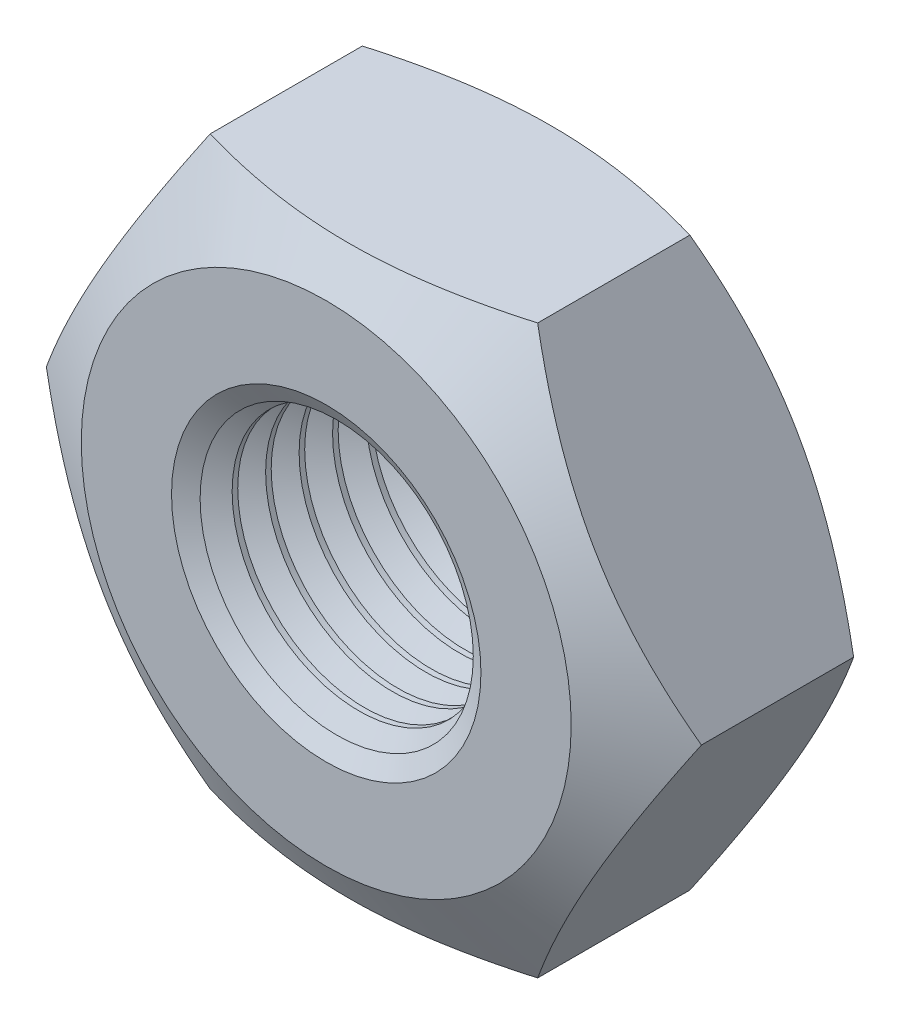
ISO-10303-21;
HEADER;
FILE_DESCRIPTION(('STEP AP214'),'2;1');
FILE_NAME('part.step','',(''),(''),'','','');
FILE_SCHEMA(('AUTOMOTIVE_DESIGN { 1 0 10303 214 1 1 1 1 }'));
ENDSEC;
DATA;
#1=APPLICATION_CONTEXT('core data for automotive mechanical design processes');
#2=APPLICATION_PROTOCOL_DEFINITION('international standard','automotive_design',2000,#1);
#3=PRODUCT_CONTEXT('',#1,'mechanical');
#4=PRODUCT('Part','Part','',(#3));
#5=PRODUCT_RELATED_PRODUCT_CATEGORY('part','',(#4));
#6=PRODUCT_DEFINITION_FORMATION('','',#4);
#7=PRODUCT_DEFINITION_CONTEXT('part definition',#1,'design');
#8=PRODUCT_DEFINITION('design','',#6,#7);
#9=PRODUCT_DEFINITION_SHAPE('','',#8);
#10=(LENGTH_UNIT() NAMED_UNIT(*) SI_UNIT(.MILLI.,.METRE.));
#11=(NAMED_UNIT(*) PLANE_ANGLE_UNIT() SI_UNIT($,.RADIAN.));
#12=(NAMED_UNIT(*) SI_UNIT($,.STERADIAN.) SOLID_ANGLE_UNIT());
#13=UNCERTAINTY_MEASURE_WITH_UNIT(LENGTH_MEASURE(1.E-05),#10,'distance_accuracy_value','');
#14=(GEOMETRIC_REPRESENTATION_CONTEXT(3) GLOBAL_UNCERTAINTY_ASSIGNED_CONTEXT((#13)) GLOBAL_UNIT_ASSIGNED_CONTEXT((#10,
#11,#12)) REPRESENTATION_CONTEXT('',''));
#15=CARTESIAN_POINT('',(0.,0.,0.));
#16=DIRECTION('',(0.,0.,1.));
#17=DIRECTION('',(1.,0.,0.));
#18=AXIS2_PLACEMENT_3D('',#15,#16,#17);
#19=CARTESIAN_POINT('',(0.,0.,-2.4));
#20=DIRECTION('',(0.,0.,1.));
#21=DIRECTION('',(1.,0.,0.));
#22=AXIS2_PLACEMENT_3D('',#19,#20,#21);
#23=CYLINDRICAL_SURFACE('',#22,1.2295);
#24=CARTESIAN_POINT('',(0.,0.,-0.966349999998783));
#25=DIRECTION('',(0.,0.,1.));
#26=DIRECTION('',(1.,0.,0.));
#27=AXIS2_PLACEMENT_3D('',#24,#25,#26);
#28=CIRCLE('',#27,1.2295000000222);
#29=CARTESIAN_POINT('',(1.2295000000222,0.,-0.966349999998783));
#30=VERTEX_POINT('',#29);
#31=EDGE_CURVE('E168',#30,#30,#28,.T.);
#32=ORIENTED_EDGE('',*,*,#31,.T.);
#33=EDGE_LOOP('',(#32));
#34=FACE_BOUND('',#33,.T.);
#35=CARTESIAN_POINT('',(0.,0.,-1.02045000005546));
#36=DIRECTION('',(0.,0.,-1.));
#37=DIRECTION('',(-1.,0.,0.));
#38=AXIS2_PLACEMENT_3D('',#35,#36,#37);
#39=CIRCLE('',#38,1.2295000000222);
#40=CARTESIAN_POINT('',(-1.2295000000222,0.,-1.02045000005546));
#41=VERTEX_POINT('',#40);
#42=EDGE_CURVE('E165',#41,#41,#39,.T.);
#43=ORIENTED_EDGE('',*,*,#42,.T.);
#44=EDGE_LOOP('',(#43));
#45=FACE_BOUND('',#44,.T.);
#46=ADVANCED_FACE('F17',(#34,#45),#23,.F.);
#47=CARTESIAN_POINT('',(0.,0.,-0.831100000027618));
#48=DIRECTION('',(0.,0.,1.));
#49=DIRECTION('',(0.,-1.,0.));
#50=AXIS2_PLACEMENT_3D('',#47,#48,#49);
#51=CONICAL_SURFACE('',#50,1.46375987173997,1.04719755127797);
#52=ORIENTED_EDGE('',*,*,#31,.F.);
#53=EDGE_LOOP('',(#52));
#54=FACE_BOUND('',#53,.T.);
#55=CARTESIAN_POINT('',(0.,0.,-0.831100000027618));
#56=DIRECTION('',(0.,0.,-1.));
#57=DIRECTION('',(-1.,0.,0.));
#58=AXIS2_PLACEMENT_3D('',#55,#56,#57);
#59=CIRCLE('',#58,1.46375987173997);
#60=CARTESIAN_POINT('',(-1.46375987173997,0.,-0.831100000027618));
#61=VERTEX_POINT('',#60);
#62=EDGE_CURVE('E162',#61,#61,#59,.F.);
#63=ORIENTED_EDGE('',*,*,#62,.T.);
#64=EDGE_LOOP('',(#63));
#65=FACE_BOUND('',#64,.T.);
#66=ADVANCED_FACE('F386',(#54,#65),#51,.F.);
#67=CARTESIAN_POINT('',(0.,0.,-1.15570000002663));
#68=DIRECTION('',(0.,0.,-1.));
#69=DIRECTION('',(-1.,0.,0.));
#70=AXIS2_PLACEMENT_3D('',#67,#68,#69);
#71=CONICAL_SURFACE('',#70,1.46375987173997,1.04719755127797);
#72=CARTESIAN_POINT('',(0.,0.,-1.15570000002663));
#73=DIRECTION('',(0.,0.,1.));
#74=DIRECTION('',(1.,0.,0.));
#75=AXIS2_PLACEMENT_3D('',#72,#73,#74);
#76=CIRCLE('',#75,1.46375987173997);
#77=CARTESIAN_POINT('',(1.46375987173997,0.,-1.15570000002663));
#78=VERTEX_POINT('',#77);
#79=EDGE_CURVE('E159',#78,#78,#76,.F.);
#80=ORIENTED_EDGE('',*,*,#79,.T.);
#81=EDGE_LOOP('',(#80));
#82=FACE_BOUND('',#81,.T.);
#83=ORIENTED_EDGE('',*,*,#42,.F.);
#84=EDGE_LOOP('',(#83));
#85=FACE_BOUND('',#84,.T.);
#86=ADVANCED_FACE('F383',(#82,#85),#71,.F.);
#87=CARTESIAN_POINT('',(0.,0.,-0.831100000027618));
#88=DIRECTION('',(0.,0.,-1.));
#89=DIRECTION('',(0.,1.,0.));
#90=AXIS2_PLACEMENT_3D('',#87,#88,#89);
#91=CONICAL_SURFACE('',#90,1.46375987173997,1.04719755127797);
#92=CARTESIAN_POINT('',(0.,0.,-0.69585));
#93=DIRECTION('',(0.,0.,1.));
#94=DIRECTION('',(1.,0.,0.));
#95=AXIS2_PLACEMENT_3D('',#92,#93,#94);
#96=CIRCLE('',#95,1.2295);
#97=CARTESIAN_POINT('',(1.2295,0.,-0.69585));
#98=VERTEX_POINT('',#97);
#99=EDGE_CURVE('E156',#98,#98,#96,.T.);
#100=ORIENTED_EDGE('',*,*,#99,.T.);
#101=EDGE_LOOP('',(#100));
#102=FACE_BOUND('',#101,.T.);
#103=ORIENTED_EDGE('',*,*,#62,.F.);
#104=EDGE_LOOP('',(#103));
#105=FACE_BOUND('',#104,.T.);
#106=ADVANCED_FACE('F379',(#102,#105),#91,.F.);
#107=CARTESIAN_POINT('',(0.,0.,-1.15570000002663));
#108=DIRECTION('',(0.,0.,1.));
#109=DIRECTION('',(1.,0.,0.));
#110=AXIS2_PLACEMENT_3D('',#107,#108,#109);
#111=CONICAL_SURFACE('',#110,1.46375987173997,1.04719755127797);
#112=ORIENTED_EDGE('',*,*,#79,.F.);
#113=EDGE_LOOP('',(#112));
#114=FACE_BOUND('',#113,.T.);
#115=CARTESIAN_POINT('',(0.,0.,-1.29095));
#116=DIRECTION('',(0.,0.,1.));
#117=DIRECTION('',(1.,0.,0.));
#118=AXIS2_PLACEMENT_3D('',#115,#116,#117);
#119=CIRCLE('',#118,1.2295);
#120=CARTESIAN_POINT('',(1.2295,0.,-1.29095));
#121=VERTEX_POINT('',#120);
#122=EDGE_CURVE('E153',#121,#121,#119,.F.);
#123=ORIENTED_EDGE('',*,*,#122,.T.);
#124=EDGE_LOOP('',(#123));
#125=FACE_BOUND('',#124,.T.);
#126=ADVANCED_FACE('F375',(#114,#125),#111,.F.);
#127=CARTESIAN_POINT('',(0.,0.,-2.4));
#128=DIRECTION('',(0.,0.,1.));
#129=DIRECTION('',(1.,0.,0.));
#130=AXIS2_PLACEMENT_3D('',#127,#128,#129);
#131=CYLINDRICAL_SURFACE('',#130,1.2295);
#132=ORIENTED_EDGE('',*,*,#99,.F.);
#133=EDGE_LOOP('',(#132));
#134=FACE_BOUND('',#133,.T.);
#135=CARTESIAN_POINT('',(0.,0.,-0.641749999999774));
#136=DIRECTION('',(0.,0.,1.));
#137=DIRECTION('',(1.,0.,0.));
#138=AXIS2_PLACEMENT_3D('',#135,#136,#137);
#139=CIRCLE('',#138,1.2295000000222);
#140=CARTESIAN_POINT('',(1.2295000000222,0.,-0.641749999999774));
#141=VERTEX_POINT('',#140);
#142=EDGE_CURVE('E150',#141,#141,#139,.T.);
#143=ORIENTED_EDGE('',*,*,#142,.T.);
#144=EDGE_LOOP('',(#143));
#145=FACE_BOUND('',#144,.T.);
#146=ADVANCED_FACE('F371',(#134,#145),#131,.F.);
#147=CARTESIAN_POINT('',(0.,0.,-2.4));
#148=DIRECTION('',(0.,0.,1.));
#149=DIRECTION('',(1.,0.,0.));
#150=AXIS2_PLACEMENT_3D('',#147,#148,#149);
#151=CYLINDRICAL_SURFACE('',#150,1.2295);
#152=ORIENTED_EDGE('',*,*,#122,.F.);
#153=EDGE_LOOP('',(#152));
#154=FACE_BOUND('',#153,.T.);
#155=CARTESIAN_POINT('',(0.,0.,-1.34505000005447));
#156=DIRECTION('',(0.,0.,-1.));
#157=DIRECTION('',(-1.,0.,0.));
#158=AXIS2_PLACEMENT_3D('',#155,#156,#157);
#159=CIRCLE('',#158,1.2295000000222);
#160=CARTESIAN_POINT('',(-1.2295000000222,0.,-1.34505000005447));
#161=VERTEX_POINT('',#160);
#162=EDGE_CURVE('E147',#161,#161,#159,.T.);
#163=ORIENTED_EDGE('',*,*,#162,.T.);
#164=EDGE_LOOP('',(#163));
#165=FACE_BOUND('',#164,.T.);
#166=ADVANCED_FACE('F367',(#154,#165),#151,.F.);
#167=CARTESIAN_POINT('',(0.,0.,-0.506500000028609));
#168=DIRECTION('',(0.,0.,1.));
#169=DIRECTION('',(1.,0.,0.));
#170=AXIS2_PLACEMENT_3D('',#167,#168,#169);
#171=CONICAL_SURFACE('',#170,1.46375987173997,1.04719755127797);
#172=ORIENTED_EDGE('',*,*,#142,.F.);
#173=EDGE_LOOP('',(#172));
#174=FACE_BOUND('',#173,.T.);
#175=CARTESIAN_POINT('',(0.,0.,-0.506499999971766));
#176=DIRECTION('',(0.,0.,-1.));
#177=DIRECTION('',(-1.,0.,0.));
#178=AXIS2_PLACEMENT_3D('',#175,#176,#177);
#179=CIRCLE('',#178,1.46375987173997);
#180=CARTESIAN_POINT('',(-1.46375987173997,0.,-0.506499999971766));
#181=VERTEX_POINT('',#180);
#182=EDGE_CURVE('E144',#181,#181,#179,.F.);
#183=ORIENTED_EDGE('',*,*,#182,.T.);
#184=EDGE_LOOP('',(#183));
#185=FACE_BOUND('',#184,.T.);
#186=ADVANCED_FACE('F363',(#174,#185),#171,.F.);
#187=CARTESIAN_POINT('',(0.,0.,-1.48030000002564));
#188=DIRECTION('',(0.,0.,-1.));
#189=DIRECTION('',(-1.,0.,0.));
#190=AXIS2_PLACEMENT_3D('',#187,#188,#189);
#191=CONICAL_SURFACE('',#190,1.46375987173997,1.04719755127797);
#192=CARTESIAN_POINT('',(0.,0.,-1.48030000002564));
#193=DIRECTION('',(0.,0.,1.));
#194=DIRECTION('',(1.,0.,0.));
#195=AXIS2_PLACEMENT_3D('',#192,#193,#194);
#196=CIRCLE('',#195,1.46375987168312);
#197=CARTESIAN_POINT('',(1.46375987168312,0.,-1.48030000002564));
#198=VERTEX_POINT('',#197);
#199=EDGE_CURVE('E141',#198,#198,#196,.F.);
#200=ORIENTED_EDGE('',*,*,#199,.T.);
#201=EDGE_LOOP('',(#200));
#202=FACE_BOUND('',#201,.T.);
#203=ORIENTED_EDGE('',*,*,#162,.F.);
#204=EDGE_LOOP('',(#203));
#205=FACE_BOUND('',#204,.T.);
#206=ADVANCED_FACE('F359',(#202,#205),#191,.F.);
#207=CARTESIAN_POINT('',(0.,0.,-0.506499999971766));
#208=DIRECTION('',(0.,0.,-1.));
#209=DIRECTION('',(-1.,0.,0.));
#210=AXIS2_PLACEMENT_3D('',#207,#208,#209);
#211=CONICAL_SURFACE('',#210,1.46375987173997,1.04719755127797);
#212=CARTESIAN_POINT('',(0.,0.,-0.37125));
#213=DIRECTION('',(0.,0.,1.));
#214=DIRECTION('',(1.,0.,0.));
#215=AXIS2_PLACEMENT_3D('',#212,#213,#214);
#216=CIRCLE('',#215,1.2295);
#217=CARTESIAN_POINT('',(1.2295,0.,-0.37125));
#218=VERTEX_POINT('',#217);
#219=EDGE_CURVE('E138',#218,#218,#216,.T.);
#220=ORIENTED_EDGE('',*,*,#219,.T.);
#221=EDGE_LOOP('',(#220));
#222=FACE_BOUND('',#221,.T.);
#223=ORIENTED_EDGE('',*,*,#182,.F.);
#224=EDGE_LOOP('',(#223));
#225=FACE_BOUND('',#224,.T.);
#226=ADVANCED_FACE('F355',(#222,#225),#211,.F.);
#227=CARTESIAN_POINT('',(0.,0.,-1.48030000013932));
#228=DIRECTION('',(0.,0.,1.));
#229=DIRECTION('',(0.,-1.,0.));
#230=AXIS2_PLACEMENT_3D('',#227,#228,#229);
#231=CONICAL_SURFACE('',#230,1.46375987151259,1.04719755127797);
#232=ORIENTED_EDGE('',*,*,#199,.F.);
#233=EDGE_LOOP('',(#232));
#234=FACE_BOUND('',#233,.T.);
#235=CARTESIAN_POINT('',(0.,0.,-1.61555));
#236=DIRECTION('',(0.,0.,1.));
#237=DIRECTION('',(1.,0.,0.));
#238=AXIS2_PLACEMENT_3D('',#235,#236,#237);
#239=CIRCLE('',#238,1.2295);
#240=CARTESIAN_POINT('',(1.2295,0.,-1.61555));
#241=VERTEX_POINT('',#240);
#242=EDGE_CURVE('E135',#241,#241,#239,.F.);
#243=ORIENTED_EDGE('',*,*,#242,.T.);
#244=EDGE_LOOP('',(#243));
#245=FACE_BOUND('',#244,.T.);
#246=ADVANCED_FACE('F351',(#234,#245),#231,.F.);
#247=CARTESIAN_POINT('',(0.,0.,-2.4));
#248=DIRECTION('',(0.,0.,1.));
#249=DIRECTION('',(1.,0.,0.));
#250=AXIS2_PLACEMENT_3D('',#247,#248,#249);
#251=CYLINDRICAL_SURFACE('',#250,1.2295);
#252=ORIENTED_EDGE('',*,*,#219,.F.);
#253=EDGE_LOOP('',(#252));
#254=FACE_BOUND('',#253,.T.);
#255=CARTESIAN_POINT('',(0.,0.,-0.317150000000765));
#256=DIRECTION('',(0.,0.,1.));
#257=DIRECTION('',(1.,0.,0.));
#258=AXIS2_PLACEMENT_3D('',#255,#256,#257);
#259=CIRCLE('',#258,1.2295000000222);
#260=CARTESIAN_POINT('',(1.2295000000222,0.,-0.317150000000765));
#261=VERTEX_POINT('',#260);
#262=EDGE_CURVE('E132',#261,#261,#259,.T.);
#263=ORIENTED_EDGE('',*,*,#262,.T.);
#264=EDGE_LOOP('',(#263));
#265=FACE_BOUND('',#264,.T.);
#266=ADVANCED_FACE('F347',(#254,#265),#251,.F.);
#267=CARTESIAN_POINT('',(0.,0.,-2.4));
#268=DIRECTION('',(0.,0.,1.));
#269=DIRECTION('',(1.,0.,0.));
#270=AXIS2_PLACEMENT_3D('',#267,#268,#269);
#271=CYLINDRICAL_SURFACE('',#270,1.2295);
#272=ORIENTED_EDGE('',*,*,#242,.F.);
#273=EDGE_LOOP('',(#272));
#274=FACE_BOUND('',#273,.T.);
#275=CARTESIAN_POINT('',(0.,0.,-1.66965000005348));
#276=DIRECTION('',(0.,0.,-1.));
#277=DIRECTION('',(-1.,0.,0.));
#278=AXIS2_PLACEMENT_3D('',#275,#276,#277);
#279=CIRCLE('',#278,1.2295000000222);
#280=CARTESIAN_POINT('',(-1.2295000000222,0.,-1.66965000005348));
#281=VERTEX_POINT('',#280);
#282=EDGE_CURVE('E129',#281,#281,#279,.T.);
#283=ORIENTED_EDGE('',*,*,#282,.T.);
#284=EDGE_LOOP('',(#283));
#285=FACE_BOUND('',#284,.T.);
#286=ADVANCED_FACE('F343',(#274,#285),#271,.F.);
#287=CARTESIAN_POINT('',(0.,0.,-0.1819000000296));
#288=DIRECTION('',(0.,0.,1.));
#289=DIRECTION('',(1.,0.,0.));
#290=AXIS2_PLACEMENT_3D('',#287,#288,#289);
#291=CONICAL_SURFACE('',#290,1.46375987173997,1.04719755127797);
#292=ORIENTED_EDGE('',*,*,#262,.F.);
#293=EDGE_LOOP('',(#292));
#294=FACE_BOUND('',#293,.T.);
#295=CARTESIAN_POINT('',(0.,0.,-0.181899999972757));
#296=DIRECTION('',(0.,0.,-1.));
#297=DIRECTION('',(-1.,0.,0.));
#298=AXIS2_PLACEMENT_3D('',#295,#296,#297);
#299=CIRCLE('',#298,1.46375987173997);
#300=CARTESIAN_POINT('',(-1.46375987173997,0.,-0.181899999972757));
#301=VERTEX_POINT('',#300);
#302=EDGE_CURVE('E126',#301,#301,#299,.F.);
#303=ORIENTED_EDGE('',*,*,#302,.T.);
#304=EDGE_LOOP('',(#303));
#305=FACE_BOUND('',#304,.T.);
#306=ADVANCED_FACE('F339',(#294,#305),#291,.F.);
#307=CARTESIAN_POINT('',(0.,0.,-1.80490000002465));
#308=DIRECTION('',(0.,0.,-1.));
#309=DIRECTION('',(-1.,0.,0.));
#310=AXIS2_PLACEMENT_3D('',#307,#308,#309);
#311=CONICAL_SURFACE('',#310,1.46375987173997,1.04719755127797);
#312=CARTESIAN_POINT('',(0.,0.,-1.80490000002465));
#313=DIRECTION('',(0.,0.,1.));
#314=DIRECTION('',(1.,0.,0.));
#315=AXIS2_PLACEMENT_3D('',#312,#313,#314);
#316=CIRCLE('',#315,1.46375987168312);
#317=CARTESIAN_POINT('',(1.46375987168312,0.,-1.80490000002465));
#318=VERTEX_POINT('',#317);
#319=EDGE_CURVE('E123',#318,#318,#316,.F.);
#320=ORIENTED_EDGE('',*,*,#319,.T.);
#321=EDGE_LOOP('',(#320));
#322=FACE_BOUND('',#321,.T.);
#323=ORIENTED_EDGE('',*,*,#282,.F.);
#324=EDGE_LOOP('',(#323));
#325=FACE_BOUND('',#324,.T.);
#326=ADVANCED_FACE('F335',(#322,#325),#311,.F.);
#327=CARTESIAN_POINT('',(0.,0.,-0.181899999972757));
#328=DIRECTION('',(0.,0.,-1.));
#329=DIRECTION('',(-1.,0.,0.));
#330=AXIS2_PLACEMENT_3D('',#327,#328,#329);
#331=CONICAL_SURFACE('',#330,1.46375987173997,1.04719755127309);
#332=CARTESIAN_POINT('',(0.,0.,-0.101411623916192));
#333=DIRECTION('',(0.,0.,1.));
#334=DIRECTION('',(1.,0.,0.));
#335=AXIS2_PLACEMENT_3D('',#332,#333,#334);
#336=CIRCLE('',#335,1.32434991485297);
#337=CARTESIAN_POINT('',(1.32434991485297,0.,-0.101411623916192));
#338=VERTEX_POINT('',#337);
#339=EDGE_CURVE('E120',#338,#338,#336,.T.);
#340=ORIENTED_EDGE('',*,*,#339,.T.);
#341=EDGE_LOOP('',(#340));
#342=FACE_BOUND('',#341,.T.);
#343=ORIENTED_EDGE('',*,*,#302,.F.);
#344=EDGE_LOOP('',(#343));
#345=FACE_BOUND('',#344,.T.);
#346=ADVANCED_FACE('F331',(#342,#345),#331,.F.);
#347=CARTESIAN_POINT('',(0.,0.,-1.80490000013833));
#348=DIRECTION('',(0.,0.,1.));
#349=DIRECTION('',(0.,-1.,0.));
#350=AXIS2_PLACEMENT_3D('',#347,#348,#349);
#351=CONICAL_SURFACE('',#350,1.46375987151259,1.04719755127797);
#352=ORIENTED_EDGE('',*,*,#319,.F.);
#353=EDGE_LOOP('',(#352));
#354=FACE_BOUND('',#353,.T.);
#355=CARTESIAN_POINT('',(0.,0.,-1.94015));
#356=DIRECTION('',(0.,0.,1.));
#357=DIRECTION('',(1.,0.,0.));
#358=AXIS2_PLACEMENT_3D('',#355,#356,#357);
#359=CIRCLE('',#358,1.2295);
#360=CARTESIAN_POINT('',(1.2295,0.,-1.94015));
#361=VERTEX_POINT('',#360);
#362=EDGE_CURVE('E117',#361,#361,#359,.F.);
#363=ORIENTED_EDGE('',*,*,#362,.T.);
#364=EDGE_LOOP('',(#363));
#365=FACE_BOUND('',#364,.T.);
#366=ADVANCED_FACE('F324',(#354,#365),#351,.F.);
#367=CARTESIAN_POINT('',(0.,0.,-5.6843418860808E-11));
#368=DIRECTION('',(0.,0.,1.));
#369=DIRECTION('',(1.,0.,0.));
#370=AXIS2_PLACEMENT_3D('',#367,#368,#369);
#371=CONICAL_SURFACE('',#370,1.49999999990769,1.04719755122284);
#372=ORIENTED_EDGE('',*,*,#339,.F.);
#373=EDGE_LOOP('',(#372));
#374=FACE_BOUND('',#373,.T.);
#375=CARTESIAN_POINT('',(0.,0.,-2.40248556818506E-11));
#376=DIRECTION('',(0.,0.,1.));
#377=DIRECTION('',(1.,0.,0.));
#378=AXIS2_PLACEMENT_3D('',#375,#376,#377);
#379=CIRCLE('',#378,1.49999999996453);
#380=CARTESIAN_POINT('',(1.49999999996453,0.,-2.40248556818506E-11));
#381=VERTEX_POINT('',#380);
#382=EDGE_CURVE('E20',#381,#381,#379,.F.);
#383=ORIENTED_EDGE('',*,*,#382,.F.);
#384=EDGE_LOOP('',(#383));
#385=FACE_BOUND('',#384,.T.);
#386=ADVANCED_FACE('F316',(#374,#385),#371,.F.);
#387=CARTESIAN_POINT('',(0.,0.,-2.4));
#388=DIRECTION('',(0.,0.,1.));
#389=DIRECTION('',(1.,0.,0.));
#390=AXIS2_PLACEMENT_3D('',#387,#388,#389);
#391=CYLINDRICAL_SURFACE('',#390,1.2295);
#392=ORIENTED_EDGE('',*,*,#362,.F.);
#393=EDGE_LOOP('',(#392));
#394=FACE_BOUND('',#393,.T.);
#395=CARTESIAN_POINT('',(0.,0.,-1.99424999999565));
#396=DIRECTION('',(0.,0.,-1.));
#397=DIRECTION('',(-1.,0.,0.));
#398=AXIS2_PLACEMENT_3D('',#395,#396,#397);
#399=CIRCLE('',#398,1.22949999996536);
#400=CARTESIAN_POINT('',(-1.22949999996536,0.,-1.99424999999565));
#401=VERTEX_POINT('',#400);
#402=EDGE_CURVE('E114',#401,#401,#399,.T.);
#403=ORIENTED_EDGE('',*,*,#402,.T.);
#404=EDGE_LOOP('',(#403));
#405=FACE_BOUND('',#404,.T.);
#406=ADVANCED_FACE('F314',(#394,#405),#391,.F.);
#407=CARTESIAN_POINT('',(3.17542648054294,0.,0.));
#408=DIRECTION('',(0.,0.,1.));
#409=DIRECTION('',(1.,0.,0.));
#410=AXIS2_PLACEMENT_3D('',#407,#408,#409);
#411=PLANE('',#410);
#412=CARTESIAN_POINT('',(0.,0.,0.));
#413=DIRECTION('',(0.,0.,-1.));
#414=DIRECTION('',(-1.,0.,0.));
#415=AXIS2_PLACEMENT_3D('',#412,#413,#414);
#416=CIRCLE('',#415,2.37499999997226);
#417=CARTESIAN_POINT('',(-2.37499999997226,0.,0.));
#418=VERTEX_POINT('',#417);
#419=EDGE_CURVE('E113',#418,#418,#416,.T.);
#420=ORIENTED_EDGE('',*,*,#419,.F.);
#421=EDGE_LOOP('',(#420));
#422=FACE_BOUND('',#421,.T.);
#423=ORIENTED_EDGE('',*,*,#382,.T.);
#424=EDGE_LOOP('',(#423));
#425=FACE_BOUND('',#424,.T.);
#426=ADVANCED_FACE('F311',(#422,#425),#411,.T.);
#427=CARTESIAN_POINT('',(0.,0.,-2.12949999996681));
#428=DIRECTION('',(0.,0.,-1.));
#429=DIRECTION('',(-1.,0.,0.));
#430=AXIS2_PLACEMENT_3D('',#427,#428,#429);
#431=CONICAL_SURFACE('',#430,1.46375987168312,1.04719755120105);
#432=CARTESIAN_POINT('',(0.,0.,-2.12950000002365));
#433=DIRECTION('',(0.,0.,1.));
#434=DIRECTION('',(1.,0.,0.));
#435=AXIS2_PLACEMENT_3D('',#432,#433,#434);
#436=CIRCLE('',#435,1.46375987173997);
#437=CARTESIAN_POINT('',(1.46375987173997,0.,-2.12950000002365));
#438=VERTEX_POINT('',#437);
#439=EDGE_CURVE('E88',#438,#438,#436,.F.);
#440=ORIENTED_EDGE('',*,*,#439,.T.);
#441=EDGE_LOOP('',(#440));
#442=FACE_BOUND('',#441,.T.);
#443=ORIENTED_EDGE('',*,*,#402,.F.);
#444=EDGE_LOOP('',(#443));
#445=FACE_BOUND('',#444,.T.);
#446=ADVANCED_FACE('F221',(#442,#445),#431,.F.);
#447=CARTESIAN_POINT('',(0.,0.,-0.464899202654578));
#448=DIRECTION('',(0.,0.,-1.));
#449=DIRECTION('',(-1.,0.,0.));
#450=AXIS2_PLACEMENT_3D('',#447,#448,#449);
#451=CONICAL_SURFACE('',#450,3.18022903940118,1.04719755121431);
#452=ORIENTED_EDGE('',*,*,#419,.T.);
#453=EDGE_LOOP('',(#452));
#454=FACE_BOUND('',#453,.T.);
#455=CARTESIAN_POINT('',(1.58771324027224,-2.75,-0.462126444005309));
#456=CARTESIAN_POINT('',(1.4481724775294,-2.75,-0.421832818556229));
#457=CARTESIAN_POINT('',(1.3074272009078,-2.75,-0.385187875021507));
#458=CARTESIAN_POINT('',(1.02349973734726,-2.75,-0.321225226686883));
#459=CARTESIAN_POINT('',(0.880312507208981,-2.75,-0.29393014697758));
#460=CARTESIAN_POINT('',(0.595712494497146,-2.75,-0.251443387565257));
#461=CARTESIAN_POINT('',(0.454343489016979,-2.75,-0.235968901960678));
#462=CARTESIAN_POINT('',(0.170940637219594,-2.75,-0.217499050194731));
#463=CARTESIAN_POINT('',(0.0289078202878818,-2.75,-0.214488385729792));
#464=CARTESIAN_POINT('',(-0.236465261237084,-2.75,-0.220767592977352));
#465=CARTESIAN_POINT('',(-0.359845347223146,-2.75,-0.228515711186402));
#466=CARTESIAN_POINT('',(-0.605801738180956,-2.75,-0.253067732500347));
#467=CARTESIAN_POINT('',(-0.728377193090174,-2.75,-0.2698800143191));
#468=CARTESIAN_POINT('',(-0.974840277408818,-2.75,-0.311907464850765));
#469=CARTESIAN_POINT('',(-1.09869672932473,-2.75,-0.337300702059782));
#470=CARTESIAN_POINT('',(-1.34456284846544,-2.75,-0.394932615161669));
#471=CARTESIAN_POINT('',(-1.46657566308962,-2.75,-0.427157758540746));
#472=CARTESIAN_POINT('',(-1.58771324027224,-2.75,-0.462126444005309));
#473=B_SPLINE_CURVE_WITH_KNOTS('',3,(#455,#456,#457,#458,#459,#460,#461,#462,#463,#464,#465,
#466,#467,#468,#469,#470,#471,#472),.UNSPECIFIED.,.F.,.F.,(4,2,2,2,2,2,2,2,4),(0.,
0.435897015887764,0.872841498406343,1.29897295845228,1.72458122222451,2.09509820111108,
2.46595826646172,2.84504223091796,3.2233822135808),.UNSPECIFIED.);
#474=CARTESIAN_POINT('',(1.58771324027128,-2.75000000000033,-0.462126444005198));
#475=VERTEX_POINT('',#474);
#476=CARTESIAN_POINT('',(-1.58771324027186,-2.75,-0.462126444005199));
#477=VERTEX_POINT('',#476);
#478=EDGE_CURVE('E98',#475,#477,#473,.T.);
#479=ORIENTED_EDGE('',*,*,#478,.F.);
#480=CARTESIAN_POINT('',(3.17542648054312,3.05719132954203E-13,-0.462126444005188));
#481=CARTESIAN_POINT('',(3.1056560991717,-0.120845845398447,-0.421832818556118));
#482=CARTESIAN_POINT('',(3.0352834608609,-0.242734830415412,-0.385187875021407));
#483=CARTESIAN_POINT('',(2.89331972908064,-0.488623226690904,-0.321225226686804));
#484=CARTESIAN_POINT('',(2.82172611401151,-0.61262700548818,-0.293930146977512));
#485=CARTESIAN_POINT('',(2.6794261076556,-0.859097846413989,-0.251443387565211));
#486=CARTESIAN_POINT('',(2.60874160491552,-0.981526996467549,-0.235968901960643));
#487=CARTESIAN_POINT('',(2.46704017901683,-1.22696106562903,-0.217499050194718));
#488=CARTESIAN_POINT('',(2.39602377055098,-1.34996509326295,-0.21448838572979));
#489=CARTESIAN_POINT('',(2.26333722978852,-1.5797849233441,-0.220767592977367));
#490=CARTESIAN_POINT('',(2.2016471867955,-1.68663521212911,-0.228515711186422));
#491=CARTESIAN_POINT('',(2.07866899131662,-1.89963969492166,-0.253067732500374));
#492=CARTESIAN_POINT('',(2.01738126386202,-2.00579315275346,-0.269880014319128));
#493=CARTESIAN_POINT('',(1.89414972170273,-2.21923644486842,-0.311907464850791));
#494=CARTESIAN_POINT('',(1.83222149574479,-2.32649927865018,-0.337300702059805));
#495=CARTESIAN_POINT('',(1.70928843617446,-2.53942558375589,-0.394932615161682));
#496=CARTESIAN_POINT('',(1.64828202886238,-2.64509178080764,-0.427157758540753));
#497=CARTESIAN_POINT('',(1.58771324027109,-2.75000000000066,-0.462126444005308));
#498=B_SPLINE_CURVE_WITH_KNOTS('',3,(#480,#481,#482,#483,#484,#485,#486,#487,#488,#489,#490,
#491,#492,#493,#494,#495,#496,#497),.UNSPECIFIED.,.F.,.F.,(4,2,2,2,2,2,2,2,4),(0.,
0.435897015887736,0.872841498406286,1.29897295845219,1.7245812222244,2.09509820111089,
2.46595826646145,2.8450422309176,3.22338221358036),.UNSPECIFIED.);
#499=CARTESIAN_POINT('',(3.1754264805681,0.,-0.462126444034539));
#500=VERTEX_POINT('',#499);
#501=EDGE_CURVE('E102',#500,#475,#498,.T.);
#502=ORIENTED_EDGE('',*,*,#501,.F.);
#503=CARTESIAN_POINT('',(1.58771324027108,2.75000000000067,-0.462126444005308));
#504=CARTESIAN_POINT('',(1.6574836216425,2.62915415460191,-0.421832818556228));
#505=CARTESIAN_POINT('',(1.7278562599533,2.50726516958494,-0.385187875021506));
#506=CARTESIAN_POINT('',(1.86981999173357,2.26137677330943,-0.321225226686882));
#507=CARTESIAN_POINT('',(1.94141360680271,2.13737299451215,-0.293930146977579));
#508=CARTESIAN_POINT('',(2.08371361315863,1.89090215358633,-0.251443387565256));
#509=CARTESIAN_POINT('',(2.15439811589871,1.76847300353276,-0.235968901960677));
#510=CARTESIAN_POINT('',(2.29609954179741,1.52303893437127,-0.21749905019473));
#511=CARTESIAN_POINT('',(2.36711595026326,1.40003490673734,-0.214488385729791));
#512=CARTESIAN_POINT('',(2.49980249102573,1.17021507665619,-0.22076759297735));
#513=CARTESIAN_POINT('',(2.56149253401874,1.06336478787119,-0.228515711186396));
#514=CARTESIAN_POINT('',(2.68447072949761,0.850360305078645,-0.253067732500329));
#515=CARTESIAN_POINT('',(2.7457584569522,0.744206847246858,-0.269880014319073));
#516=CARTESIAN_POINT('',(2.86898999911149,0.530763555131907,-0.311907464850718));
#517=CARTESIAN_POINT('',(2.93091822506943,0.423500721350151,-0.337300702059721));
#518=CARTESIAN_POINT('',(3.05385128463975,0.210574416244461,-0.394932615161579));
#519=CARTESIAN_POINT('',(3.11485769195182,0.104908219192713,-0.427157758540641));
#520=CARTESIAN_POINT('',(3.17542648054312,-3.05718508423455E-13,-0.462126444005188));
#521=B_SPLINE_CURVE_WITH_KNOTS('',3,(#503,#504,#505,#506,#507,#508,#509,#510,#511,#512,#513,
#514,#515,#516,#517,#518,#519,#520),.UNSPECIFIED.,.F.,.F.,(4,2,2,2,2,2,2,2,4),(0.,
0.435897015887764,0.872841498406342,1.29897295845228,1.72458122222451,2.09509820111097,
2.46595826646151,2.84504223091763,3.22338221358036),.UNSPECIFIED.);
#522=CARTESIAN_POINT('',(1.58771324027185,2.75,-0.462126444005197));
#523=VERTEX_POINT('',#522);
#524=EDGE_CURVE('E106',#523,#500,#521,.T.);
#525=ORIENTED_EDGE('',*,*,#524,.F.);
#526=CARTESIAN_POINT('',(-1.58771324027224,2.75,-0.462126444005309));
#527=CARTESIAN_POINT('',(-1.4481724775294,2.75,-0.421832818556229));
#528=CARTESIAN_POINT('',(-1.3074272009078,2.75,-0.385187875021507));
#529=CARTESIAN_POINT('',(-1.02349973734726,2.75,-0.321225226686883));
#530=CARTESIAN_POINT('',(-0.88031250720898,2.75,-0.293930146977579));
#531=CARTESIAN_POINT('',(-0.595712494497145,2.75,-0.251443387565256));
#532=CARTESIAN_POINT('',(-0.454343489016977,2.75,-0.235968901960677));
#533=CARTESIAN_POINT('',(-0.170940637219593,2.75,-0.21749905019473));
#534=CARTESIAN_POINT('',(-0.0289078202878804,2.75,-0.214488385729792));
#535=CARTESIAN_POINT('',(0.236465261237084,2.75,-0.220767592977352));
#536=CARTESIAN_POINT('',(0.359845347223146,2.75,-0.228515711186402));
#537=CARTESIAN_POINT('',(0.605801738180955,2.75,-0.253067732500347));
#538=CARTESIAN_POINT('',(0.728377193090173,2.75,-0.269880014319099));
#539=CARTESIAN_POINT('',(0.974840277408816,2.75,-0.311907464850765));
#540=CARTESIAN_POINT('',(1.09869672932473,2.75,-0.337300702059781));
#541=CARTESIAN_POINT('',(1.34456284846544,2.75,-0.394932615161668));
#542=CARTESIAN_POINT('',(1.46657566308962,2.75,-0.427157758540745));
#543=CARTESIAN_POINT('',(1.58771324027224,2.75,-0.462126444005308));
#544=B_SPLINE_CURVE_WITH_KNOTS('',3,(#526,#527,#528,#529,#530,#531,#532,#533,#534,#535,#536,
#537,#538,#539,#540,#541,#542,#543),.UNSPECIFIED.,.F.,.F.,(4,2,2,2,2,2,2,2,4),(0.,
0.435897015887764,0.872841498406343,1.29897295845228,1.72458122222451,2.09509820111108,
2.46595826646172,2.84504223091795,3.22338221358079),.UNSPECIFIED.);
#545=CARTESIAN_POINT('',(-1.58771324027128,2.75000000000033,-0.462126444005198));
#546=VERTEX_POINT('',#545);
#547=EDGE_CURVE('E84',#546,#523,#544,.T.);
#548=ORIENTED_EDGE('',*,*,#547,.F.);
#549=CARTESIAN_POINT('',(-3.17542648054312,-3.07264087956928E-13,-0.462126444005189));
#550=CARTESIAN_POINT('',(-3.1056560991717,0.120845845398446,-0.421832818556118));
#551=CARTESIAN_POINT('',(-3.03528346086091,0.242734830415411,-0.385187875021407));
#552=CARTESIAN_POINT('',(-2.89331972908064,0.488623226690903,-0.321225226686804));
#553=CARTESIAN_POINT('',(-2.82172611401151,0.612627005488178,-0.293930146977512));
#554=CARTESIAN_POINT('',(-2.6794261076556,0.859097846413988,-0.251443387565211));
#555=CARTESIAN_POINT('',(-2.60874160491552,0.981526996467548,-0.235968901960644));
#556=CARTESIAN_POINT('',(-2.46704017901683,1.22696106562903,-0.217499050194718));
#557=CARTESIAN_POINT('',(-2.39602377055098,1.34996509326295,-0.21448838572979));
#558=CARTESIAN_POINT('',(-2.26333722978852,1.57978492334409,-0.220767592977367));
#559=CARTESIAN_POINT('',(-2.2016471867955,1.68663521212911,-0.228515711186422));
#560=CARTESIAN_POINT('',(-2.07866899131662,1.89963969492166,-0.253067732500374));
#561=CARTESIAN_POINT('',(-2.01738126386202,2.00579315275346,-0.269880014319128));
#562=CARTESIAN_POINT('',(-1.89414972170273,2.21923644486842,-0.311907464850791));
#563=CARTESIAN_POINT('',(-1.83222149574479,2.32649927865018,-0.337300702059805));
#564=CARTESIAN_POINT('',(-1.70928843617446,2.53942558375589,-0.394932615161682));
#565=CARTESIAN_POINT('',(-1.64828202886238,2.64509178080764,-0.427157758540753));
#566=CARTESIAN_POINT('',(-1.58771324027109,2.75000000000066,-0.462126444005308));
#567=B_SPLINE_CURVE_WITH_KNOTS('',3,(#549,#550,#551,#552,#553,#554,#555,#556,#557,#558,#559,
#560,#561,#562,#563,#564,#565,#566),.UNSPECIFIED.,.F.,.F.,(4,2,2,2,2,2,2,2,4),(0.,
0.435897015887736,0.872841498406286,1.2989729584522,1.7245812222244,2.09509820111089,
2.46595826646145,2.84504223091761,3.22338221358036),.UNSPECIFIED.);
#568=CARTESIAN_POINT('',(-3.17542648054086,1.51972194081546E-13,-0.462126444005654));
#569=VERTEX_POINT('',#568);
#570=EDGE_CURVE('E81',#569,#546,#567,.T.);
#571=ORIENTED_EDGE('',*,*,#570,.F.);
#572=CARTESIAN_POINT('',(-1.58771324027109,-2.75000000000067,-0.46212644400531));
#573=CARTESIAN_POINT('',(-1.65748362164251,-2.62915415460191,-0.42183281855623));
#574=CARTESIAN_POINT('',(-1.72785625995331,-2.50726516958494,-0.385187875021509));
#575=CARTESIAN_POINT('',(-1.86981999173358,-2.26137677330943,-0.321225226686885));
#576=CARTESIAN_POINT('',(-1.94141360680272,-2.13737299451215,-0.293930146977581));
#577=CARTESIAN_POINT('',(-2.08371361315864,-1.89090215358633,-0.251443387565258));
#578=CARTESIAN_POINT('',(-2.15439811589872,-1.76847300353276,-0.23596890196068));
#579=CARTESIAN_POINT('',(-2.29609954179741,-1.52303893437127,-0.217499050194732));
#580=CARTESIAN_POINT('',(-2.36711595026327,-1.40003490673734,-0.214488385729794));
#581=CARTESIAN_POINT('',(-2.49980249102573,-1.17021507665619,-0.220767592977353));
#582=CARTESIAN_POINT('',(-2.56149253401875,-1.06336478787118,-0.228515711186399));
#583=CARTESIAN_POINT('',(-2.68447072949762,-0.850360305078644,-0.253067732500332));
#584=CARTESIAN_POINT('',(-2.74575845695221,-0.744206847246857,-0.269880014319077));
#585=CARTESIAN_POINT('',(-2.8689899991115,-0.530763555131907,-0.311907464850721));
#586=CARTESIAN_POINT('',(-2.93091822506944,-0.423500721350151,-0.337300702059724));
#587=CARTESIAN_POINT('',(-3.05385128463976,-0.210574416244462,-0.394932615161582));
#588=CARTESIAN_POINT('',(-3.11485769195183,-0.104908219192715,-0.427157758540644));
#589=CARTESIAN_POINT('',(-3.17542648054312,3.03999072149927E-13,-0.46212644400519));
#590=B_SPLINE_CURVE_WITH_KNOTS('',3,(#572,#573,#574,#575,#576,#577,#578,#579,#580,#581,#582,
#583,#584,#585,#586,#587,#588,#589),.UNSPECIFIED.,.F.,.F.,(4,2,2,2,2,2,2,2,4),(0.,
0.435897015887765,0.872841498406343,1.29897295845228,1.72458122222451,2.09509820111097,
2.46595826646151,2.84504223091763,3.22338221358036),.UNSPECIFIED.);
#591=EDGE_CURVE('E67',#477,#569,#590,.T.);
#592=ORIENTED_EDGE('',*,*,#591,.F.);
#593=EDGE_LOOP('',(#479,#502,#525,#548,#571,#592));
#594=FACE_BOUND('',#593,.T.);
#595=ADVANCED_FACE('F82',(#454,#594),#451,.T.);
#596=CARTESIAN_POINT('',(0.,0.,-2.12950000002365));
#597=DIRECTION('',(0.,0.,1.));
#598=DIRECTION('',(1.,0.,0.));
#599=AXIS2_PLACEMENT_3D('',#596,#597,#598);
#600=CONICAL_SURFACE('',#599,1.46375987173997,1.04719755122669);
#601=ORIENTED_EDGE('',*,*,#439,.F.);
#602=EDGE_LOOP('',(#601));
#603=FACE_BOUND('',#602,.T.);
#604=CARTESIAN_POINT('',(0.,0.,-2.23093750003045));
#605=DIRECTION('',(0.,0.,-1.));
#606=DIRECTION('',(-1.,0.,0.));
#607=AXIS2_PLACEMENT_3D('',#604,#605,#606);
#608=CIRCLE('',#607,1.28806496792322);
#609=CARTESIAN_POINT('',(-1.28806496792322,0.,-2.23093750003045));
#610=VERTEX_POINT('',#609);
#611=EDGE_CURVE('E93',#610,#610,#608,.T.);
#612=ORIENTED_EDGE('',*,*,#611,.T.);
#613=EDGE_LOOP('',(#612));
#614=FACE_BOUND('',#613,.T.);
#615=ADVANCED_FACE('F220',(#603,#614),#600,.F.);
#616=CARTESIAN_POINT('',(-1.58771324027147,2.75,-2.4));
#617=DIRECTION('',(-0.866025403784439,0.5,0.));
#618=DIRECTION('',(-0.5,-0.866025403784439,0.));
#619=AXIS2_PLACEMENT_3D('',#616,#617,#618);
#620=PLANE('',#619);
#621=CARTESIAN_POINT('',(-3.17542648055386,-2.16782990584374E-11,-1.93787355604286));
#622=CARTESIAN_POINT('',(-3.10565609919838,0.120845845351243,-1.97816718148716));
#623=CARTESIAN_POINT('',(-3.03528346090313,0.242734830342004,-2.01481212501807));
#624=CARTESIAN_POINT('',(-2.89331972915583,0.488623226560948,-2.07877477334788));
#625=CARTESIAN_POINT('',(-2.82172611410413,0.612627005327826,-2.10606985305643));
#626=CARTESIAN_POINT('',(-2.67942610774914,0.859097846251892,-2.14855661248353));
#627=CARTESIAN_POINT('',(-2.60874160499213,0.981526996334837,-2.16403109809814));
#628=CARTESIAN_POINT('',(-2.46704017905655,1.22696106556025,-2.18250094987624));
#629=CARTESIAN_POINT('',(-2.39602377057074,1.34996509322873,-2.18551161434304));
#630=CARTESIAN_POINT('',(-2.26333723388957,1.57978491624086,-2.17923240729083));
#631=CARTESIAN_POINT('',(-2.201647194989,1.68663519793754,-2.17148428991877));
#632=CARTESIAN_POINT('',(-2.07866900762708,1.89963966667111,-2.1469322714303));
#633=CARTESIAN_POINT('',(-2.01738128419683,2.00579311753254,-2.13011999160276));
#634=CARTESIAN_POINT('',(-1.89414975017927,2.21923639554561,-2.088092546036));
#635=CARTESIAN_POINT('',(-1.83222152833472,2.32649922220276,-2.06269931183662));
#636=CARTESIAN_POINT('',(-1.70928847684165,2.53942551331825,-2.00506740540849));
#637=CARTESIAN_POINT('',(-1.64828207349397,2.64509170350347,-1.97284226568956));
#638=CARTESIAN_POINT('',(-1.58771328881153,2.74999991592614,-1.93787358407537));
#639=B_SPLINE_CURVE_WITH_KNOTS('',3,(#621,#622,#623,#624,#625,#626,#627,#628,#629,#630,#631,
#632,#633,#634,#635,#636,#637,#638),.UNSPECIFIED.,.F.,.F.,(4,2,2,2,2,2,2,2,4),(0.,
0.435897015796498,0.872841498211403,1.29897295836256,1.72458122224907,2.09509817654605,
2.46595821721618,2.84504215571146,3.22338211261091),.UNSPECIFIED.);
#640=CARTESIAN_POINT('',(-3.17542648055607,0.,-1.93787355603276));
#641=VERTEX_POINT('',#640);
#642=CARTESIAN_POINT('',(-1.58771326511534,2.74999995696916,-1.93787357039437));
#643=VERTEX_POINT('',#642);
#644=EDGE_CURVE('E91',#641,#643,#639,.T.);
#645=ORIENTED_EDGE('',*,*,#644,.F.);
#646=DIRECTION('',(0.,0.,1.));
#647=VECTOR('',#646,1.);
#648=CARTESIAN_POINT('',(-3.17542648054295,0.,-2.4));
#649=LINE('',#648,#647);
#650=EDGE_CURVE('E72',#569,#641,#649,.F.);
#651=ORIENTED_EDGE('',*,*,#650,.F.);
#652=ORIENTED_EDGE('',*,*,#570,.T.);
#653=DIRECTION('',(0.,0.,1.));
#654=VECTOR('',#653,1.);
#655=CARTESIAN_POINT('',(-1.58771324027147,2.75,-2.4));
#656=LINE('',#655,#654);
#657=EDGE_CURVE('E107',#643,#546,#656,.T.);
#658=ORIENTED_EDGE('',*,*,#657,.F.);
#659=EDGE_LOOP('',(#645,#651,#652,#658));
#660=FACE_BOUND('',#659,.T.);
#661=ADVANCED_FACE('F90',(#660),#620,.T.);
#662=CARTESIAN_POINT('',(1.58771324027147,2.75,-2.4));
#663=DIRECTION('',(0.,1.,0.));
#664=DIRECTION('',(0.,0.,1.));
#665=AXIS2_PLACEMENT_3D('',#662,#663,#664);
#666=PLANE('',#665);
#667=CARTESIAN_POINT('',(-1.58771330693399,2.75,-1.93787353680694));
#668=CARTESIAN_POINT('',(-1.44817254311855,2.75,-1.97816716382453));
#669=CARTESIAN_POINT('',(-1.30742726541762,2.75,-2.01481210902834));
#670=CARTESIAN_POINT('',(-1.02349979959514,2.75,-2.07877476083349));
#671=CARTESIAN_POINT('',(-0.880312568273637,2.75,-2.10606984234252));
#672=CARTESIAN_POINT('',(-0.595712553129412,2.75,-2.1485566053408));
#673=CARTESIAN_POINT('',(-0.454343546403591,2.75,-2.1640310927332));
#674=CARTESIAN_POINT('',(-0.170940691967135,2.75,-2.18250094794318));
#675=CARTESIAN_POINT('',(-0.0289078736422558,2.75,-2.18551161406535));
#676=CARTESIAN_POINT('',(0.23646520537685,2.75,-2.17923240976178));
#677=CARTESIAN_POINT('',(0.35984528745882,2.75,-2.17148429328462));
#678=CARTESIAN_POINT('',(0.605801670758285,2.75,-2.14693227586985));
#679=CARTESIAN_POINT('',(0.72837712191348,2.75,-2.13011999621954));
#680=CARTESIAN_POINT('',(0.974840198690757,2.75,-2.08809255034686));
#681=CARTESIAN_POINT('',(1.09869664682408,2.75,-2.06269931564123));
#682=CARTESIAN_POINT('',(1.34456275856181,2.75,-2.00506740767226));
#683=CARTESIAN_POINT('',(1.46657556956497,2.75,-1.97284226692086));
#684=CARTESIAN_POINT('',(1.58771314316976,2.75,-1.9378735840816));
#685=B_SPLINE_CURVE_WITH_KNOTS('',3,(#667,#668,#669,#670,#671,#672,#673,#674,#675,#676,#677,
#678,#679,#680,#681,#682,#683,#684),.UNSPECIFIED.,.F.,.F.,(4,2,2,2,2,2,2,2,4),(0.,
0.435897020291391,0.8728415073175,1.2989729716637,1.72458123970174,2.09509820660405,
2.4659582599282,2.84504221176341,3.22338218191755),.UNSPECIFIED.);
#686=CARTESIAN_POINT('',(1.58771319057423,2.75,-1.93787357039711));
#687=VERTEX_POINT('',#686);
#688=EDGE_CURVE('E259',#643,#687,#685,.T.);
#689=ORIENTED_EDGE('',*,*,#688,.F.);
#690=ORIENTED_EDGE('',*,*,#657,.T.);
#691=ORIENTED_EDGE('',*,*,#547,.T.);
#692=DIRECTION('',(0.,0.,1.));
#693=VECTOR('',#692,1.);
#694=CARTESIAN_POINT('',(1.58771324027147,2.75,-2.4));
#695=LINE('',#694,#693);
#696=EDGE_CURVE('E103',#687,#523,#695,.T.);
#697=ORIENTED_EDGE('',*,*,#696,.F.);
#698=EDGE_LOOP('',(#689,#690,#691,#697));
#699=FACE_BOUND('',#698,.T.);
#700=ADVANCED_FACE('F251',(#699),#666,.T.);
#701=CARTESIAN_POINT('',(3.17542648054294,0.,-2.4));
#702=DIRECTION('',(0.866025403784438,0.5,0.));
#703=DIRECTION('',(-0.5,0.866025403784438,0.));
#704=AXIS2_PLACEMENT_3D('',#701,#702,#703);
#705=PLANE('',#704);
#706=CARTESIAN_POINT('',(1.58771320695251,2.75000005771013,-1.93787353681405));
#707=CARTESIAN_POINT('',(1.6574835888758,2.6291542113555,-1.97816716384005));
#708=CARTESIAN_POINT('',(1.72785622774204,2.50726522537647,-2.01481210905072));
#709=CARTESIAN_POINT('',(1.86981996068731,2.26137682708314,-2.07877476086577));
#710=CARTESIAN_POINT('',(1.94141357636634,2.1373730472295,-2.10606984237755));
#711=CARTESIAN_POINT('',(2.08371358394079,1.89090220419311,-2.14855660536394));
#712=CARTESIAN_POINT('',(2.15439808728733,1.76847305308913,-2.16403109274725));
#713=CARTESIAN_POINT('',(2.29609951446986,1.52303898170397,-2.18250094794584));
#714=CARTESIAN_POINT('',(2.36711592361297,1.40003495289701,-2.18551161406597));
#715=CARTESIAN_POINT('',(2.49980246720573,1.17021511791364,-2.17923240956563));
#716=CARTESIAN_POINT('',(2.56149251234045,1.06336482541908,-2.17148429225027));
#717=CARTESIAN_POINT('',(2.68447071210963,0.850360335195506,-2.14693227200665));
#718=CARTESIAN_POINT('',(2.74575844171277,0.744206873642325,-2.13011999036297));
#719=CARTESIAN_POINT('',(2.86898998824567,0.530763573952067,-2.08809253952019));
#720=CARTESIAN_POINT('',(2.93091821642704,0.423500736319205,-2.06269930180184));
#721=CARTESIAN_POINT('',(3.05385128037562,0.210574423630159,-2.0050673871524));
#722=CARTESIAN_POINT('',(3.11485768984274,0.104908222845758,-1.97284224273721));
#723=CARTESIAN_POINT('',(3.17542648055507,-2.10041126802635E-11,-1.93787355604376));
#724=B_SPLINE_CURVE_WITH_KNOTS('',3,(#706,#707,#708,#709,#710,#711,#712,#713,#714,#715,#716,
#717,#718,#719,#720,#721,#722,#723),.UNSPECIFIED.,.F.,.F.,(4,2,2,2,2,2,2,2,4),(0.,
0.435897020388,0.872841507523296,1.29897297176797,1.72458123969534,2.09509823119504,
2.46595830920758,2.84504228701322,3.22338228294005),.UNSPECIFIED.);
#725=CARTESIAN_POINT('',(3.17542648054688,-1.05972580296582E-11,-1.93787355605862));
#726=VERTEX_POINT('',#725);
#727=EDGE_CURVE('E265',#687,#726,#724,.T.);
#728=ORIENTED_EDGE('',*,*,#727,.F.);
#729=ORIENTED_EDGE('',*,*,#696,.T.);
#730=ORIENTED_EDGE('',*,*,#524,.T.);
#731=DIRECTION('',(0.,0.,1.));
#732=VECTOR('',#731,1.);
#733=CARTESIAN_POINT('',(3.17542648054294,0.,-2.4));
#734=LINE('',#733,#732);
#735=EDGE_CURVE('E99',#726,#500,#734,.T.);
#736=ORIENTED_EDGE('',*,*,#735,.F.);
#737=EDGE_LOOP('',(#728,#729,#730,#736));
#738=FACE_BOUND('',#737,.T.);
#739=ADVANCED_FACE('F255',(#738),#705,.T.);
#740=CARTESIAN_POINT('',(1.58771324027147,-2.75,-2.4));
#741=DIRECTION('',(0.866025403784439,-0.5,0.));
#742=DIRECTION('',(0.5,0.866025403784439,0.));
#743=AXIS2_PLACEMENT_3D('',#740,#741,#742);
#744=PLANE('',#743);
#745=CARTESIAN_POINT('',(3.17542648055386,2.16767467217767E-11,-1.93787355604286));
#746=CARTESIAN_POINT('',(3.10565609919838,-0.120845845351237,-1.97816718148716));
#747=CARTESIAN_POINT('',(3.03528346090314,-0.242734830341991,-2.01481212501807));
#748=CARTESIAN_POINT('',(2.89331972915585,-0.488623226560917,-2.07877477334787));
#749=CARTESIAN_POINT('',(2.82172611410415,-0.612627005327786,-2.10606985305643));
#750=CARTESIAN_POINT('',(2.67942610774917,-0.85909784625185,-2.14855661248352));
#751=CARTESIAN_POINT('',(2.60874160499215,-0.981526996334803,-2.16403109809814));
#752=CARTESIAN_POINT('',(2.46704017905656,-1.22696106556023,-2.18250094987624));
#753=CARTESIAN_POINT('',(2.39602377057074,-1.34996509322872,-2.18551161434304));
#754=CARTESIAN_POINT('',(2.26333723389073,-1.57978491623885,-2.17923240729089));
#755=CARTESIAN_POINT('',(2.20164719499132,-1.68663519793353,-2.17148428991906));
#756=CARTESIAN_POINT('',(2.07866900763169,-1.89963966666313,-2.14693227143139));
#757=CARTESIAN_POINT('',(2.01738128420258,-2.00579311752259,-2.13011999160441));
#758=CARTESIAN_POINT('',(1.89414975018731,-2.21923639553167,-2.08809254603906));
#759=CARTESIAN_POINT('',(1.83222152834393,-2.32649922218681,-2.06269931184053));
#760=CARTESIAN_POINT('',(1.70928847685314,-2.53942551329834,-2.00506740541429));
#761=CARTESIAN_POINT('',(1.64828207350658,-2.64509170348162,-1.97284226569639));
#762=CARTESIAN_POINT('',(1.58771328882525,-2.74999991590238,-1.93787358408329));
#763=B_SPLINE_CURVE_WITH_KNOTS('',3,(#745,#746,#747,#748,#749,#750,#751,#752,#753,#754,#755,
#756,#757,#758,#759,#760,#761,#762),.UNSPECIFIED.,.F.,.F.,(4,2,2,2,2,2,2,2,4),(0.,
0.43589701579647,0.872841498211344,1.29897295836253,1.72458122224907,2.0950981765391,
2.46595821720225,2.8450421556902,3.22338211258237),.UNSPECIFIED.);
#764=CARTESIAN_POINT('',(1.58771326512163,-2.74999995695826,-1.937873570398));
#765=VERTEX_POINT('',#764);
#766=EDGE_CURVE('E270',#726,#765,#763,.T.);
#767=ORIENTED_EDGE('',*,*,#766,.F.);
#768=ORIENTED_EDGE('',*,*,#735,.T.);
#769=ORIENTED_EDGE('',*,*,#501,.T.);
#770=DIRECTION('',(0.,0.,1.));
#771=VECTOR('',#770,1.);
#772=CARTESIAN_POINT('',(1.58771324027147,-2.75,-2.4));
#773=LINE('',#772,#771);
#774=EDGE_CURVE('E77',#765,#475,#773,.T.);
#775=ORIENTED_EDGE('',*,*,#774,.F.);
#776=EDGE_LOOP('',(#767,#768,#769,#775));
#777=FACE_BOUND('',#776,.T.);
#778=ADVANCED_FACE('F275',(#777),#744,.T.);
#779=CARTESIAN_POINT('',(-1.58771324027147,-2.75,-2.4));
#780=DIRECTION('',(0.,-1.,0.));
#781=DIRECTION('',(1.,0.,0.));
#782=AXIS2_PLACEMENT_3D('',#779,#780,#781);
#783=PLANE('',#782);
#784=CARTESIAN_POINT('',(1.58771330691555,-2.75,-1.93787353681227));
#785=CARTESIAN_POINT('',(1.44817254310041,-2.75,-1.97816716382942));
#786=CARTESIAN_POINT('',(1.30742726539977,-2.75,-2.01481210903277));
#787=CARTESIAN_POINT('',(1.02349979957792,-2.75,-2.07877476083696));
#788=CARTESIAN_POINT('',(0.880312568256745,-2.75,-2.10606984234549));
#789=CARTESIAN_POINT('',(0.595712553113192,-2.75,-2.14855660534278));
#790=CARTESIAN_POINT('',(0.454343546387716,-2.75,-2.16403109273469));
#791=CARTESIAN_POINT('',(0.170940691951989,-2.75,-2.18250094794372));
#792=CARTESIAN_POINT('',(0.0289078736274943,-2.75,-2.18551161406543));
#793=CARTESIAN_POINT('',(-0.236465205392299,-2.75,-2.17923240976104));
#794=CARTESIAN_POINT('',(-0.359845287475343,-2.75,-2.17148429328341));
#795=CARTESIAN_POINT('',(-0.605801670776915,-2.75,-2.14693227586756));
#796=CARTESIAN_POINT('',(-0.728377121933142,-2.75,-2.13011999621665));
#797=CARTESIAN_POINT('',(-0.974840198712493,-2.75,-2.08809255034268));
#798=CARTESIAN_POINT('',(-1.09869664684686,-2.75,-2.06269931563636));
#799=CARTESIAN_POINT('',(-1.34456275858662,-2.75,-2.00506740766598));
#800=CARTESIAN_POINT('',(-1.46657556959077,-2.75,-1.97284226691385));
#801=CARTESIAN_POINT('',(-1.58771314319655,-2.75,-1.93787358407387));
#802=B_SPLINE_CURVE_WITH_KNOTS('',3,(#784,#785,#786,#787,#788,#789,#790,#791,#792,#793,#794,
#795,#796,#797,#798,#799,#800,#801),.UNSPECIFIED.,.F.,.F.,(4,2,2,2,2,2,2,2,4),(0.,
0.435897020290175,0.872841507315039,1.29897297166005,1.72458123969691,2.09509820660252,
2.46595825992997,2.84504221176866,3.22338218192624),.UNSPECIFIED.);
#803=CARTESIAN_POINT('',(-1.58771319058648,-2.75,-1.93787357039358));
#804=VERTEX_POINT('',#803);
#805=EDGE_CURVE('E35',#765,#804,#802,.T.);
#806=ORIENTED_EDGE('',*,*,#805,.F.);
#807=ORIENTED_EDGE('',*,*,#774,.T.);
#808=ORIENTED_EDGE('',*,*,#478,.T.);
#809=DIRECTION('',(0.,0.,1.));
#810=VECTOR('',#809,1.);
#811=CARTESIAN_POINT('',(-1.58771324027147,-2.75,-2.4));
#812=LINE('',#811,#810);
#813=EDGE_CURVE('E74',#804,#477,#812,.T.);
#814=ORIENTED_EDGE('',*,*,#813,.F.);
#815=EDGE_LOOP('',(#806,#807,#808,#814));
#816=FACE_BOUND('',#815,.T.);
#817=ADVANCED_FACE('F194',(#816),#783,.T.);
#818=CARTESIAN_POINT('',(-3.17542648054295,0.,-2.4));
#819=DIRECTION('',(-0.866025403784439,-0.5,0.));
#820=DIRECTION('',(0.5,-0.866025403784439,0.));
#821=AXIS2_PLACEMENT_3D('',#818,#819,#820);
#822=PLANE('',#821);
#823=CARTESIAN_POINT('',(-1.58771320694296,-2.75000005772669,-1.93787353680853));
#824=CARTESIAN_POINT('',(-1.65748358886641,-2.62915421137178,-1.97816716383498));
#825=CARTESIAN_POINT('',(-1.72785622773281,-2.50726522539248,-2.01481210904613));
#826=CARTESIAN_POINT('',(-1.8698199606784,-2.26137682709857,-2.07877476086218));
#827=CARTESIAN_POINT('',(-1.94141357635761,-2.13737304724462,-2.10606984237447));
#828=CARTESIAN_POINT('',(-2.08371358393241,-1.89090220420763,-2.14855660536189));
#829=CARTESIAN_POINT('',(-2.15439808727912,-1.76847305310336,-2.16403109274571));
#830=CARTESIAN_POINT('',(-2.29609951446202,-1.52303898171755,-2.18250094794529));
#831=CARTESIAN_POINT('',(-2.36711592360533,-1.40003495291025,-2.18551161406588));
#832=CARTESIAN_POINT('',(-2.4998024671989,-1.17021511792549,-2.17923240956634));
#833=CARTESIAN_POINT('',(-2.56149251233424,-1.06336482542986,-2.17148429225124));
#834=CARTESIAN_POINT('',(-2.68447071210465,-0.850360335204152,-2.14693227200792));
#835=CARTESIAN_POINT('',(-2.7457584417084,-0.744206873649904,-2.13011999036429));
#836=CARTESIAN_POINT('',(-2.86898998824255,-0.530763573957473,-2.08809253952142));
#837=CARTESIAN_POINT('',(-2.93091821642456,-0.423500736323507,-2.06269930180293));
#838=CARTESIAN_POINT('',(-3.05385128037439,-0.210574423632286,-2.00506738715304));
#839=CARTESIAN_POINT('',(-3.11485768984213,-0.104908222846815,-1.97284224273756));
#840=CARTESIAN_POINT('',(-3.17542648055507,2.10013487133351E-11,-1.93787355604375));
#841=B_SPLINE_CURVE_WITH_KNOTS('',3,(#823,#824,#825,#826,#827,#828,#829,#830,#831,#832,#833,
#834,#835,#836,#837,#838,#839,#840),.UNSPECIFIED.,.F.,.F.,(4,2,2,2,2,2,2,2,4),(0.,
0.435897020389291,0.87284150752591,1.29897297177179,1.72458123970035,2.09509823120367,
2.46595830921984,2.8450422870293,3.22338228295994),.UNSPECIFIED.);
#842=EDGE_CURVE('E173',#804,#641,#841,.T.);
#843=ORIENTED_EDGE('',*,*,#842,.F.);
#844=ORIENTED_EDGE('',*,*,#813,.T.);
#845=ORIENTED_EDGE('',*,*,#591,.T.);
#846=ORIENTED_EDGE('',*,*,#650,.T.);
#847=EDGE_LOOP('',(#843,#844,#845,#846));
#848=FACE_BOUND('',#847,.T.);
#849=ADVANCED_FACE('F70',(#848),#822,.T.);
#850=CARTESIAN_POINT('',(0.,0.,-2.3999999998523));
#851=DIRECTION('',(0.,0.,-1.));
#852=DIRECTION('',(-1.,0.,0.));
#853=AXIS2_PLACEMENT_3D('',#850,#851,#852);
#854=CONICAL_SURFACE('',#853,1.38567324768246,0.523598775564844);
#855=CARTESIAN_POINT('',(0.,0.,-2.40000000002283));
#856=DIRECTION('',(0.,0.,-1.));
#857=DIRECTION('',(-1.,0.,0.));
#858=AXIS2_PLACEMENT_3D('',#855,#856,#857);
#859=CIRCLE('',#858,1.38567324778092);
#860=CARTESIAN_POINT('',(-1.38567324778092,0.,-2.40000000002283));
#861=VERTEX_POINT('',#860);
#862=EDGE_CURVE('E26',#861,#861,#859,.T.);
#863=ORIENTED_EDGE('',*,*,#862,.T.);
#864=EDGE_LOOP('',(#863));
#865=FACE_BOUND('',#864,.T.);
#866=ORIENTED_EDGE('',*,*,#611,.F.);
#867=EDGE_LOOP('',(#866));
#868=FACE_BOUND('',#867,.T.);
#869=ADVANCED_FACE('F193',(#865,#868),#854,.F.);
#870=CARTESIAN_POINT('',(0.,0.,-1.93510079736825));
#871=DIRECTION('',(0.,0.,1.));
#872=DIRECTION('',(1.,0.,0.));
#873=AXIS2_PLACEMENT_3D('',#870,#871,#872);
#874=CONICAL_SURFACE('',#873,3.18022903945803,1.04719755118374);
#875=CARTESIAN_POINT('',(0.,0.,-2.40000000002283));
#876=DIRECTION('',(0.,0.,1.));
#877=DIRECTION('',(1.,0.,0.));
#878=AXIS2_PLACEMENT_3D('',#875,#876,#877);
#879=CIRCLE('',#878,2.37500000008595);
#880=CARTESIAN_POINT('',(2.37500000008595,0.,-2.40000000002283));
#881=VERTEX_POINT('',#880);
#882=EDGE_CURVE('E11',#881,#881,#879,.T.);
#883=ORIENTED_EDGE('',*,*,#882,.T.);
#884=EDGE_LOOP('',(#883));
#885=FACE_BOUND('',#884,.T.);
#886=ORIENTED_EDGE('',*,*,#805,.T.);
#887=ORIENTED_EDGE('',*,*,#842,.T.);
#888=ORIENTED_EDGE('',*,*,#644,.T.);
#889=ORIENTED_EDGE('',*,*,#688,.T.);
#890=ORIENTED_EDGE('',*,*,#727,.T.);
#891=ORIENTED_EDGE('',*,*,#766,.T.);
#892=EDGE_LOOP('',(#886,#887,#888,#889,#890,#891));
#893=FACE_BOUND('',#892,.T.);
#894=ADVANCED_FACE('F187',(#885,#893),#874,.T.);
#895=CARTESIAN_POINT('',(3.17542648054294,0.,-2.4));
#896=DIRECTION('',(0.,0.,1.));
#897=DIRECTION('',(1.,0.,0.));
#898=AXIS2_PLACEMENT_3D('',#895,#896,#897);
#899=PLANE('',#898);
#900=ORIENTED_EDGE('',*,*,#882,.F.);
#901=EDGE_LOOP('',(#900));
#902=FACE_BOUND('',#901,.T.);
#903=ORIENTED_EDGE('',*,*,#862,.F.);
#904=EDGE_LOOP('',(#903));
#905=FACE_BOUND('',#904,.T.);
#906=ADVANCED_FACE('F288',(#902,#905),#899,.F.);
#907=CLOSED_SHELL('',(#46,#66,#86,#106,#126,#146,#166,#186,#206,#226,#246,#266,#286,#306,#326,
#346,#366,#386,#406,#426,#446,#595,#615,#661,#700,#739,#778,#817,#849,#869,#894,#906));
#908=MANIFOLD_SOLID_BREP('B1',#907);
#909=ADVANCED_BREP_SHAPE_REPRESENTATION('',(#18,#908),#14);
#910=SHAPE_DEFINITION_REPRESENTATION(#9,#909);
ENDSEC;
END-ISO-10303-21;
